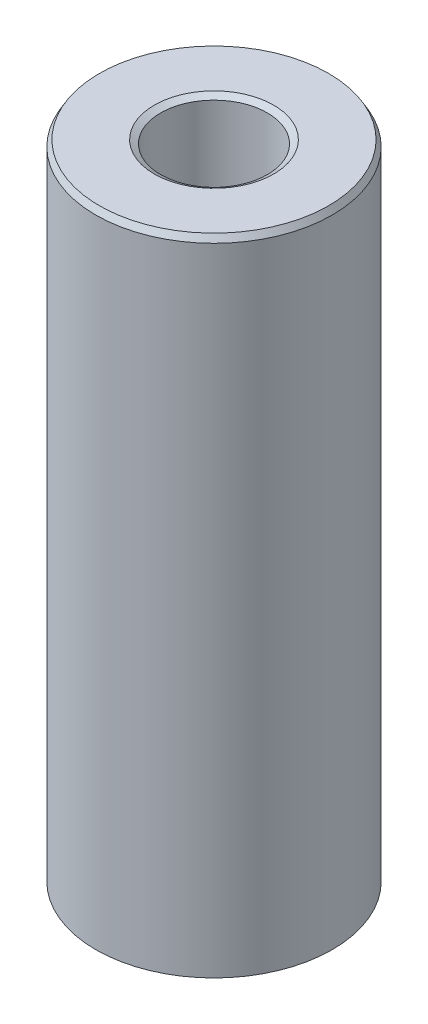
ISO-10303-21;
HEADER;
FILE_DESCRIPTION(('STEP AP214'),'2;1');
FILE_NAME('part.step','',(''),(''),'','','');
FILE_SCHEMA(('AUTOMOTIVE_DESIGN { 1 0 10303 214 1 1 1 1 }'));
ENDSEC;
DATA;
#1=APPLICATION_CONTEXT('core data for automotive mechanical design processes');
#2=APPLICATION_PROTOCOL_DEFINITION('international standard','automotive_design',2000,#1);
#3=PRODUCT_CONTEXT('',#1,'mechanical');
#4=PRODUCT('Part','Part','',(#3));
#5=PRODUCT_RELATED_PRODUCT_CATEGORY('part','',(#4));
#6=PRODUCT_DEFINITION_FORMATION('','',#4);
#7=PRODUCT_DEFINITION_CONTEXT('part definition',#1,'design');
#8=PRODUCT_DEFINITION('design','',#6,#7);
#9=PRODUCT_DEFINITION_SHAPE('','',#8);
#10=(LENGTH_UNIT() NAMED_UNIT(*) SI_UNIT(.MILLI.,.METRE.));
#11=(NAMED_UNIT(*) PLANE_ANGLE_UNIT() SI_UNIT($,.RADIAN.));
#12=(NAMED_UNIT(*) SI_UNIT($,.STERADIAN.) SOLID_ANGLE_UNIT());
#13=UNCERTAINTY_MEASURE_WITH_UNIT(LENGTH_MEASURE(1.E-05),#10,'distance_accuracy_value','');
#14=(GEOMETRIC_REPRESENTATION_CONTEXT(3) GLOBAL_UNCERTAINTY_ASSIGNED_CONTEXT((#13)) GLOBAL_UNIT_ASSIGNED_CONTEXT((#10,
#11,#12)) REPRESENTATION_CONTEXT('',''));
#15=CARTESIAN_POINT('',(0.,0.,0.));
#16=DIRECTION('',(0.,0.,1.));
#17=DIRECTION('',(1.,0.,0.));
#18=AXIS2_PLACEMENT_3D('',#15,#16,#17);
#19=CARTESIAN_POINT('',(0.,327.8927979961,0.));
#20=DIRECTION('',(0.,-1.,0.));
#21=DIRECTION('',(0.,0.,-1.));
#22=AXIS2_PLACEMENT_3D('',#19,#20,#21);
#23=CYLINDRICAL_SURFACE('',#22,60.);
#24=CARTESIAN_POINT('',(0.,1.83400520751759,0.));
#25=DIRECTION('',(0.,1.,0.));
#26=DIRECTION('',(0.,0.,1.));
#27=AXIS2_PLACEMENT_3D('',#24,#25,#26);
#28=CIRCLE('',#27,60.);
#29=CARTESIAN_POINT('',(0.,1.83400520751759,60.));
#30=VERTEX_POINT('',#29);
#31=EDGE_CURVE('E10',#30,#30,#28,.T.);
#32=ORIENTED_EDGE('',*,*,#31,.T.);
#33=EDGE_LOOP('',(#32));
#34=FACE_BOUND('',#33,.T.);
#35=CARTESIAN_POINT('',(0.,324.716207795334,0.));
#36=DIRECTION('',(0.,1.,0.));
#37=DIRECTION('',(0.,0.,1.));
#38=AXIS2_PLACEMENT_3D('',#35,#36,#37);
#39=CIRCLE('',#38,60.);
#40=CARTESIAN_POINT('',(0.,324.716207795334,-60.));
#41=VERTEX_POINT('',#40);
#42=EDGE_CURVE('E50',#41,#41,#39,.F.);
#43=ORIENTED_EDGE('',*,*,#42,.T.);
#44=EDGE_LOOP('',(#43));
#45=FACE_BOUND('',#44,.T.);
#46=ADVANCED_FACE('F39',(#34,#45),#23,.T.);
#47=CARTESIAN_POINT('',(0.,327.8927979961,0.));
#48=DIRECTION('',(0.,1.,0.));
#49=DIRECTION('',(0.,0.,1.));
#50=AXIS2_PLACEMENT_3D('',#47,#48,#49);
#51=PLANE('',#50);
#52=CARTESIAN_POINT('',(0.,327.8927979961,0.));
#53=DIRECTION('',(0.,1.,0.));
#54=DIRECTION('',(0.,0.,1.));
#55=AXIS2_PLACEMENT_3D('',#52,#53,#54);
#56=CIRCLE('',#55,30.295688158403);
#57=CARTESIAN_POINT('',(0.,327.8927979961,30.295688158403));
#58=VERTEX_POINT('',#57);
#59=EDGE_CURVE('E58',#58,#58,#56,.F.);
#60=ORIENTED_EDGE('',*,*,#59,.T.);
#61=EDGE_LOOP('',(#60));
#62=FACE_BOUND('',#61,.T.);
#63=CARTESIAN_POINT('',(0.,327.8927979961,0.));
#64=DIRECTION('',(0.,1.,0.));
#65=DIRECTION('',(0.,0.,1.));
#66=AXIS2_PLACEMENT_3D('',#63,#64,#65);
#67=CIRCLE('',#66,58.1659947924824);
#68=CARTESIAN_POINT('',(0.,327.8927979961,-58.1659947924824));
#69=VERTEX_POINT('',#68);
#70=EDGE_CURVE('E61',#69,#69,#67,.T.);
#71=ORIENTED_EDGE('',*,*,#70,.T.);
#72=EDGE_LOOP('',(#71));
#73=FACE_BOUND('',#72,.T.);
#74=ADVANCED_FACE('F88',(#62,#73),#51,.T.);
#75=CARTESIAN_POINT('',(0.,0.,0.));
#76=DIRECTION('',(0.,1.,0.));
#77=DIRECTION('',(0.,0.,1.));
#78=AXIS2_PLACEMENT_3D('',#75,#76,#77);
#79=PLANE('',#78);
#80=CARTESIAN_POINT('',(0.,0.,0.));
#81=DIRECTION('',(0.,1.,0.));
#82=DIRECTION('',(0.,0.,1.));
#83=AXIS2_PLACEMENT_3D('',#80,#81,#82);
#84=CIRCLE('',#83,28.9531031651543);
#85=CARTESIAN_POINT('',(0.,0.,28.9531031651543));
#86=VERTEX_POINT('',#85);
#87=EDGE_CURVE('E51',#86,#86,#84,.T.);
#88=ORIENTED_EDGE('',*,*,#87,.T.);
#89=EDGE_LOOP('',(#88));
#90=FACE_BOUND('',#89,.T.);
#91=CARTESIAN_POINT('',(0.,0.,0.));
#92=DIRECTION('',(0.,1.,0.));
#93=DIRECTION('',(0.,0.,1.));
#94=AXIS2_PLACEMENT_3D('',#91,#92,#93);
#95=CIRCLE('',#94,56.8234097992337);
#96=CARTESIAN_POINT('',(0.,0.,56.8234097992337));
#97=VERTEX_POINT('',#96);
#98=EDGE_CURVE('E54',#97,#97,#95,.F.);
#99=ORIENTED_EDGE('',*,*,#98,.T.);
#100=EDGE_LOOP('',(#99));
#101=FACE_BOUND('',#100,.T.);
#102=ADVANCED_FACE('F83',(#90,#101),#79,.F.);
#103=CARTESIAN_POINT('',(0.,327.8927979961,0.));
#104=DIRECTION('',(0.,-1.,0.));
#105=DIRECTION('',(0.,0.,-1.));
#106=AXIS2_PLACEMENT_3D('',#103,#104,#105);
#107=CYLINDRICAL_SURFACE('',#106,27.1190979576368);
#108=CARTESIAN_POINT('',(0.,326.058792788583,0.));
#109=DIRECTION('',(0.,1.,0.));
#110=DIRECTION('',(0.,0.,1.));
#111=AXIS2_PLACEMENT_3D('',#108,#109,#110);
#112=CIRCLE('',#111,27.1190979576368);
#113=CARTESIAN_POINT('',(0.,326.058792788583,27.1190979576368));
#114=VERTEX_POINT('',#113);
#115=EDGE_CURVE('E67',#114,#114,#112,.T.);
#116=ORIENTED_EDGE('',*,*,#115,.T.);
#117=EDGE_LOOP('',(#116));
#118=FACE_BOUND('',#117,.T.);
#119=CARTESIAN_POINT('',(0.,3.17659020076627,0.));
#120=DIRECTION('',(0.,1.,0.));
#121=DIRECTION('',(0.,0.,1.));
#122=AXIS2_PLACEMENT_3D('',#119,#120,#121);
#123=CIRCLE('',#122,27.1190979576368);
#124=CARTESIAN_POINT('',(0.,3.17659020076627,27.1190979576368));
#125=VERTEX_POINT('',#124);
#126=EDGE_CURVE('E69',#125,#125,#123,.F.);
#127=ORIENTED_EDGE('',*,*,#126,.T.);
#128=EDGE_LOOP('',(#127));
#129=FACE_BOUND('',#128,.T.);
#130=ADVANCED_FACE('F71',(#118,#129),#107,.F.);
#131=CARTESIAN_POINT('',(0.,326.058792788583,0.));
#132=DIRECTION('',(0.,1.,0.));
#133=DIRECTION('',(0.,0.,1.));
#134=AXIS2_PLACEMENT_3D('',#131,#132,#133);
#135=CONICAL_SURFACE('',#134,27.1190979576368,1.04719755119659);
#136=ORIENTED_EDGE('',*,*,#59,.F.);
#137=EDGE_LOOP('',(#136));
#138=FACE_BOUND('',#137,.T.);
#139=ORIENTED_EDGE('',*,*,#115,.F.);
#140=EDGE_LOOP('',(#139));
#141=FACE_BOUND('',#140,.T.);
#142=ADVANCED_FACE('F77',(#138,#141),#135,.F.);
#143=CARTESIAN_POINT('',(0.,0.,0.));
#144=DIRECTION('',(0.,-1.,0.));
#145=DIRECTION('',(0.,0.,-1.));
#146=AXIS2_PLACEMENT_3D('',#143,#144,#145);
#147=CONICAL_SURFACE('',#146,28.9531031651543,0.523598775598301);
#148=ORIENTED_EDGE('',*,*,#126,.F.);
#149=EDGE_LOOP('',(#148));
#150=FACE_BOUND('',#149,.T.);
#151=ORIENTED_EDGE('',*,*,#87,.F.);
#152=EDGE_LOOP('',(#151));
#153=FACE_BOUND('',#152,.T.);
#154=ADVANCED_FACE('F73',(#150,#153),#147,.F.);
#155=CARTESIAN_POINT('',(0.,1.83400520751759,0.));
#156=DIRECTION('',(0.,1.,0.));
#157=DIRECTION('',(0.,0.,1.));
#158=AXIS2_PLACEMENT_3D('',#155,#156,#157);
#159=CONICAL_SURFACE('',#158,60.,1.04719755119659);
#160=ORIENTED_EDGE('',*,*,#98,.F.);
#161=EDGE_LOOP('',(#160));
#162=FACE_BOUND('',#161,.T.);
#163=ORIENTED_EDGE('',*,*,#31,.F.);
#164=EDGE_LOOP('',(#163));
#165=FACE_BOUND('',#164,.T.);
#166=ADVANCED_FACE('F76',(#162,#165),#159,.T.);
#167=CARTESIAN_POINT('',(0.,327.8927979961,0.));
#168=DIRECTION('',(0.,-1.,0.));
#169=DIRECTION('',(0.,0.,-1.));
#170=AXIS2_PLACEMENT_3D('',#167,#168,#169);
#171=CONICAL_SURFACE('',#170,58.1659947924824,0.523598775598303);
#172=CARTESIAN_POINT('',(0.,324.716207795334,-60.));
#173=CARTESIAN_POINT('',(0.,324.749297276592,-59.9808957790884));
#174=CARTESIAN_POINT('',(0.,324.78238675785,-59.9617915581767));
#175=CARTESIAN_POINT('',(0.,324.848565720366,-59.9235831163534));
#176=CARTESIAN_POINT('',(0.,324.881655201624,-59.9044788954418));
#177=CARTESIAN_POINT('',(0.,324.94783416414,-59.8662704536185));
#178=CARTESIAN_POINT('',(0.,324.980923645398,-59.8471662327069));
#179=CARTESIAN_POINT('',(0.,325.047102607914,-59.8089577908836));
#180=CARTESIAN_POINT('',(0.,325.080192089172,-59.789853569972));
#181=CARTESIAN_POINT('',(0.,325.146371051687,-59.7516451281487));
#182=CARTESIAN_POINT('',(0.,325.179460532945,-59.732540907237));
#183=CARTESIAN_POINT('',(0.,325.245639495461,-59.6943324654137));
#184=CARTESIAN_POINT('',(0.,325.278728976719,-59.6752282445021));
#185=CARTESIAN_POINT('',(0.,325.344907939235,-59.6370198026788));
#186=CARTESIAN_POINT('',(0.,325.377997420493,-59.6179155817672));
#187=CARTESIAN_POINT('',(0.,325.444176383009,-59.5797071399439));
#188=CARTESIAN_POINT('',(0.,325.477265864267,-59.5606029190322));
#189=CARTESIAN_POINT('',(0.,325.543444826783,-59.522394477209));
#190=CARTESIAN_POINT('',(0.,325.576534308041,-59.5032902562973));
#191=CARTESIAN_POINT('',(0.,325.642713270557,-59.465081814474));
#192=CARTESIAN_POINT('',(0.,325.675802751815,-59.4459775935624));
#193=CARTESIAN_POINT('',(0.,325.741981714331,-59.4077691517391));
#194=CARTESIAN_POINT('',(0.,325.775071195589,-59.3886649308275));
#195=CARTESIAN_POINT('',(0.,325.841250158105,-59.3504564890042));
#196=CARTESIAN_POINT('',(0.,325.874339639363,-59.3313522680926));
#197=CARTESIAN_POINT('',(0.,325.940518601879,-59.2931438262693));
#198=CARTESIAN_POINT('',(0.,325.973608083137,-59.2740396053576));
#199=CARTESIAN_POINT('',(0.,326.039787045653,-59.2358311635343));
#200=CARTESIAN_POINT('',(0.,326.072876526911,-59.2167269426227));
#201=CARTESIAN_POINT('',(0.,326.139055489427,-59.1785185007994));
#202=CARTESIAN_POINT('',(0.,326.172144970685,-59.1594142798878));
#203=CARTESIAN_POINT('',(0.,326.238323933201,-59.1212058380645));
#204=CARTESIAN_POINT('',(0.,326.271413414459,-59.1021016171528));
#205=CARTESIAN_POINT('',(0.,326.337592376975,-59.0638931753296));
#206=CARTESIAN_POINT('',(0.,326.370681858233,-59.0447889544179));
#207=CARTESIAN_POINT('',(0.,326.436860820749,-59.0065805125946));
#208=CARTESIAN_POINT('',(0.,326.469950302007,-58.987476291683));
#209=CARTESIAN_POINT('',(0.,326.536129264523,-58.9492678498597));
#210=CARTESIAN_POINT('',(0.,326.569218745781,-58.9301636289481));
#211=CARTESIAN_POINT('',(0.,326.635397708297,-58.8919551871248));
#212=CARTESIAN_POINT('',(0.,326.668487189555,-58.8728509662132));
#213=CARTESIAN_POINT('',(0.,326.734666152071,-58.8346425243899));
#214=CARTESIAN_POINT('',(0.,326.767755633329,-58.8155383034782));
#215=CARTESIAN_POINT('',(0.,326.833934595845,-58.7773298616549));
#216=CARTESIAN_POINT('',(0.,326.867024077103,-58.7582256407433));
#217=CARTESIAN_POINT('',(0.,326.933203039619,-58.72001719892));
#218=CARTESIAN_POINT('',(0.,326.966292520877,-58.7009129780084));
#219=CARTESIAN_POINT('',(0.,327.032471483392,-58.6627045361851));
#220=CARTESIAN_POINT('',(0.,327.065560964651,-58.6436003152734));
#221=CARTESIAN_POINT('',(0.,327.131739927166,-58.6053918734502));
#222=CARTESIAN_POINT('',(0.,327.164829408424,-58.5862876525385));
#223=CARTESIAN_POINT('',(0.,327.23100837094,-58.5480792107152));
#224=CARTESIAN_POINT('',(0.,327.264097852198,-58.5289749898036));
#225=CARTESIAN_POINT('',(0.,327.330276814714,-58.4907665479803));
#226=CARTESIAN_POINT('',(0.,327.363366295972,-58.4716623270687));
#227=CARTESIAN_POINT('',(0.,327.429545258488,-58.4334538852454));
#228=CARTESIAN_POINT('',(0.,327.462634739746,-58.4143496643337));
#229=CARTESIAN_POINT('',(0.,327.528813702262,-58.3761412225105));
#230=CARTESIAN_POINT('',(0.,327.56190318352,-58.3570370015988));
#231=CARTESIAN_POINT('',(0.,327.628082146036,-58.3188285597755));
#232=CARTESIAN_POINT('',(0.,327.661171627294,-58.2997243388639));
#233=CARTESIAN_POINT('',(0.,327.72735058981,-58.2615158970406));
#234=CARTESIAN_POINT('',(0.,327.760440071068,-58.242411676129));
#235=CARTESIAN_POINT('',(0.,327.826619033584,-58.2042032343057));
#236=CARTESIAN_POINT('',(0.,327.859708514842,-58.185099013394));
#237=CARTESIAN_POINT('',(0.,327.8927979961,-58.1659947924824));
#238=B_SPLINE_CURVE_WITH_KNOTS('',3,(#172,#173,#174,#175,#176,#177,#178,#179,#180,#181,#182,
#183,#184,#185,#186,#187,#188,#189,#190,#191,#192,#193,#194,#195,#196,#197,#198,#199,#200,#201,
#202,#203,#204,#205,#206,#207,#208,#209,#210,#211,#212,#213,#214,#215,#216,#217,#218,#219,#220,
#221,#222,#223,#224,#225,#226,#227,#228,#229,#230,#231,#232,#233,#234,#235,#236,#237),
.UNSPECIFIED.,.F.,.F.,(4,2,2,2,2,2,2,2,2,2,2,2,2,2,2,2,2,2,2,2,2,2,2,2,2,2,2,2,2,2,2,2,4),(0.,
0.114625325469894,0.229250650939743,0.343875976409592,0.458501301879441,0.57312662734929,
0.687751952819139,0.802377278288988,0.917002603758837,1.03162792922868,1.14625325469853,
1.26087858016838,1.37550390563823,1.49012923110808,1.60475455657793,1.71937988204778,
1.83400520751763,1.94863053298748,2.06325585845732,2.17788118392717,2.29250650939702,
2.40713183486687,2.52175716033672,2.63638248580657,2.75100781127642,2.86563313674627,
2.98025846221611,3.09488378768596,3.20950911315581,3.32413443862566,3.43875976409551,
3.55338508956536,3.66801041503525),.UNSPECIFIED.);
#239=EDGE_CURVE('BSEAM45',#41,#69,#238,.T.);
#240=ORIENTED_EDGE('',*,*,#42,.F.);
#241=ORIENTED_EDGE('',*,*,#70,.F.);
#242=ORIENTED_EDGE('',*,*,#239,.T.);
#243=ORIENTED_EDGE('',*,*,#239,.F.);
#244=EDGE_LOOP('',(#240,#242,#241,#243));
#245=FACE_BOUND('',#244,.T.);
#246=ADVANCED_FACE('F45',(#245),#171,.T.);
#247=CLOSED_SHELL('',(#46,#74,#102,#130,#142,#154,#166,#246));
#248=MANIFOLD_SOLID_BREP('B2',#247);
#249=ADVANCED_BREP_SHAPE_REPRESENTATION('',(#18,#248),#14);
#250=SHAPE_DEFINITION_REPRESENTATION(#9,#249);
ENDSEC;
END-ISO-10303-21;
